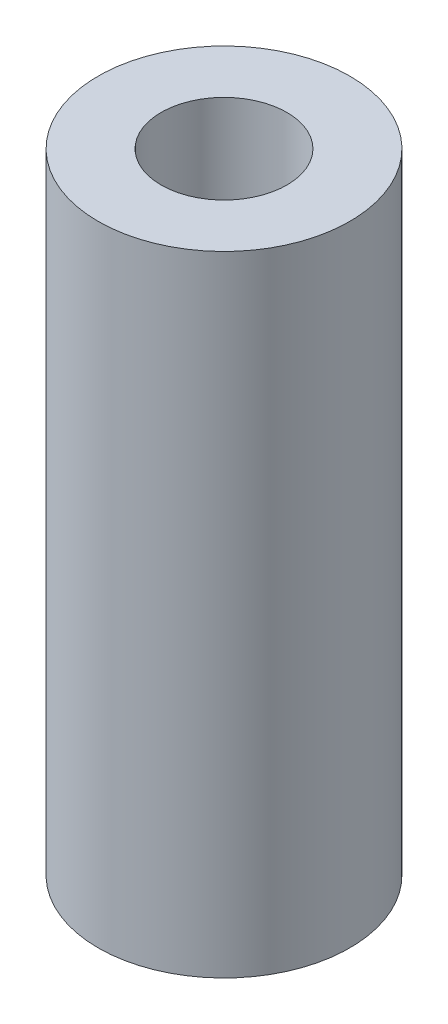
ISO-10303-21;
HEADER;
FILE_DESCRIPTION(('STEP AP214'),'2;1');
FILE_NAME('part.step','',(''),(''),'','','');
FILE_SCHEMA(('AUTOMOTIVE_DESIGN { 1 0 10303 214 1 1 1 1 }'));
ENDSEC;
DATA;
#1=APPLICATION_CONTEXT('core data for automotive mechanical design processes');
#2=APPLICATION_PROTOCOL_DEFINITION('international standard','automotive_design',2000,#1);
#3=PRODUCT_CONTEXT('',#1,'mechanical');
#4=PRODUCT('Part','Part','',(#3));
#5=PRODUCT_RELATED_PRODUCT_CATEGORY('part','',(#4));
#6=PRODUCT_DEFINITION_FORMATION('','',#4);
#7=PRODUCT_DEFINITION_CONTEXT('part definition',#1,'design');
#8=PRODUCT_DEFINITION('design','',#6,#7);
#9=PRODUCT_DEFINITION_SHAPE('','',#8);
#10=(LENGTH_UNIT() NAMED_UNIT(*) SI_UNIT(.MILLI.,.METRE.));
#11=(NAMED_UNIT(*) PLANE_ANGLE_UNIT() SI_UNIT($,.RADIAN.));
#12=(NAMED_UNIT(*) SI_UNIT($,.STERADIAN.) SOLID_ANGLE_UNIT());
#13=UNCERTAINTY_MEASURE_WITH_UNIT(LENGTH_MEASURE(1.E-05),#10,'distance_accuracy_value','');
#14=(GEOMETRIC_REPRESENTATION_CONTEXT(3) GLOBAL_UNCERTAINTY_ASSIGNED_CONTEXT((#13)) GLOBAL_UNIT_ASSIGNED_CONTEXT((#10,
#11,#12)) REPRESENTATION_CONTEXT('',''));
#15=CARTESIAN_POINT('',(0.,0.,0.));
#16=DIRECTION('',(0.,0.,1.));
#17=DIRECTION('',(1.,0.,0.));
#18=AXIS2_PLACEMENT_3D('',#15,#16,#17);
#19=CARTESIAN_POINT('',(0.,25.,0.));
#20=DIRECTION('',(0.,1.,0.));
#21=DIRECTION('',(0.,0.,1.));
#22=AXIS2_PLACEMENT_3D('',#19,#20,#21);
#23=PLANE('',#22);
#24=CARTESIAN_POINT('',(0.,25.,0.));
#25=DIRECTION('',(0.,1.,0.));
#26=DIRECTION('',(0.,0.,1.));
#27=AXIS2_PLACEMENT_3D('',#24,#25,#26);
#28=CIRCLE('',#27,5.);
#29=CARTESIAN_POINT('',(0.,25.,5.));
#30=VERTEX_POINT('',#29);
#31=EDGE_CURVE('E10',#30,#30,#28,.T.);
#32=ORIENTED_EDGE('',*,*,#31,.T.);
#33=EDGE_LOOP('',(#32));
#34=FACE_BOUND('',#33,.T.);
#35=CARTESIAN_POINT('',(0.,25.,0.));
#36=DIRECTION('',(0.,1.,0.));
#37=DIRECTION('',(0.,0.,1.));
#38=AXIS2_PLACEMENT_3D('',#35,#36,#37);
#39=CIRCLE('',#38,2.5);
#40=CARTESIAN_POINT('',(0.,25.,2.5));
#41=VERTEX_POINT('',#40);
#42=EDGE_CURVE('E42',#41,#41,#39,.T.);
#43=ORIENTED_EDGE('',*,*,#42,.F.);
#44=EDGE_LOOP('',(#43));
#45=FACE_BOUND('',#44,.T.);
#46=ADVANCED_FACE('F31',(#34,#45),#23,.T.);
#47=CARTESIAN_POINT('',(0.,0.,0.));
#48=DIRECTION('',(0.,1.,0.));
#49=DIRECTION('',(0.,0.,1.));
#50=AXIS2_PLACEMENT_3D('',#47,#48,#49);
#51=PLANE('',#50);
#52=CARTESIAN_POINT('',(0.,0.,0.));
#53=DIRECTION('',(0.,1.,0.));
#54=DIRECTION('',(0.,0.,1.));
#55=AXIS2_PLACEMENT_3D('',#52,#53,#54);
#56=CIRCLE('',#55,5.);
#57=CARTESIAN_POINT('',(0.,0.,5.));
#58=VERTEX_POINT('',#57);
#59=EDGE_CURVE('E35',#58,#58,#56,.T.);
#60=ORIENTED_EDGE('',*,*,#59,.F.);
#61=EDGE_LOOP('',(#60));
#62=FACE_BOUND('',#61,.T.);
#63=CARTESIAN_POINT('',(0.,0.,0.));
#64=DIRECTION('',(0.,1.,0.));
#65=DIRECTION('',(0.,0.,1.));
#66=AXIS2_PLACEMENT_3D('',#63,#64,#65);
#67=CIRCLE('',#66,2.5);
#68=CARTESIAN_POINT('',(0.,0.,2.5));
#69=VERTEX_POINT('',#68);
#70=EDGE_CURVE('E44',#69,#69,#67,.T.);
#71=ORIENTED_EDGE('',*,*,#70,.T.);
#72=EDGE_LOOP('',(#71));
#73=FACE_BOUND('',#72,.T.);
#74=ADVANCED_FACE('F54',(#62,#73),#51,.F.);
#75=CARTESIAN_POINT('',(0.,25.,0.));
#76=DIRECTION('',(0.,-1.,0.));
#77=DIRECTION('',(0.,0.,-1.));
#78=AXIS2_PLACEMENT_3D('',#75,#76,#77);
#79=CYLINDRICAL_SURFACE('',#78,5.);
#80=ORIENTED_EDGE('',*,*,#31,.F.);
#81=EDGE_LOOP('',(#80));
#82=FACE_BOUND('',#81,.T.);
#83=ORIENTED_EDGE('',*,*,#59,.T.);
#84=EDGE_LOOP('',(#83));
#85=FACE_BOUND('',#84,.T.);
#86=ADVANCED_FACE('F33',(#82,#85),#79,.T.);
#87=CARTESIAN_POINT('',(0.,25.,0.));
#88=DIRECTION('',(0.,-1.,0.));
#89=DIRECTION('',(0.,0.,-1.));
#90=AXIS2_PLACEMENT_3D('',#87,#88,#89);
#91=CYLINDRICAL_SURFACE('',#90,2.5);
#92=ORIENTED_EDGE('',*,*,#42,.T.);
#93=EDGE_LOOP('',(#92));
#94=FACE_BOUND('',#93,.T.);
#95=ORIENTED_EDGE('',*,*,#70,.F.);
#96=EDGE_LOOP('',(#95));
#97=FACE_BOUND('',#96,.T.);
#98=ADVANCED_FACE('F50',(#94,#97),#91,.F.);
#99=CLOSED_SHELL('',(#46,#74,#86,#98));
#100=MANIFOLD_SOLID_BREP('B2',#99);
#101=ADVANCED_BREP_SHAPE_REPRESENTATION('',(#18,#100),#14);
#102=SHAPE_DEFINITION_REPRESENTATION(#9,#101);
ENDSEC;
END-ISO-10303-21;
